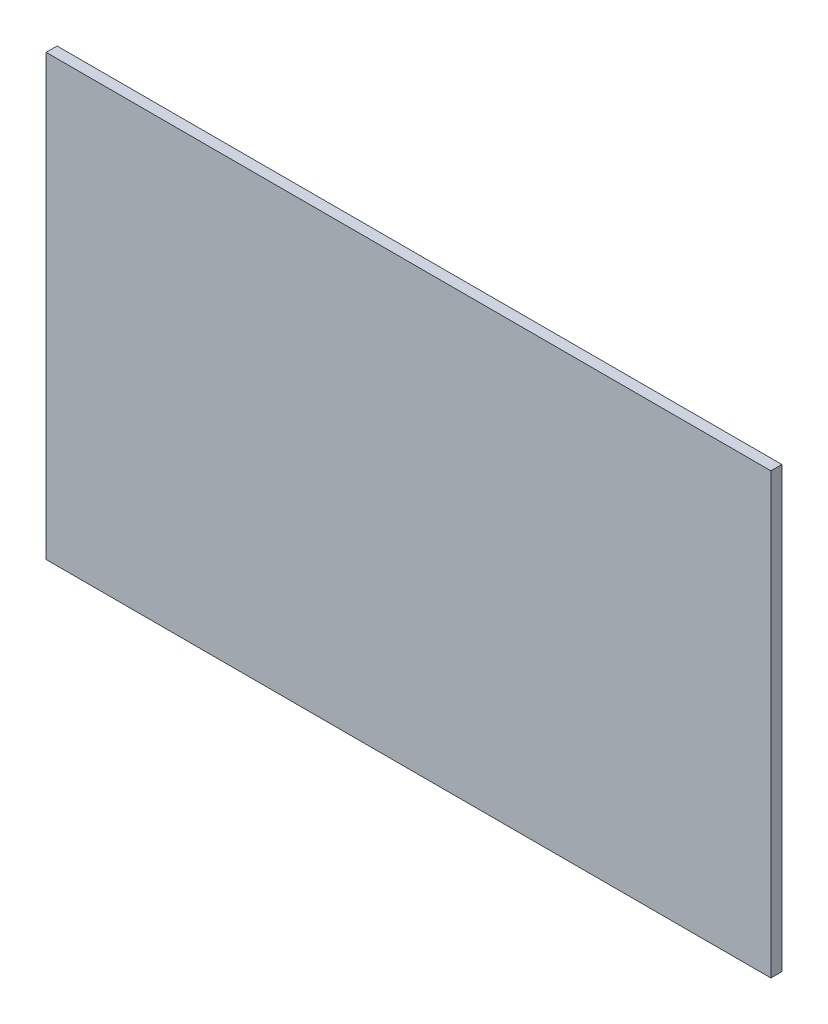
ISO-10303-21;
HEADER;
FILE_DESCRIPTION(('STEP AP214'),'2;1');
FILE_NAME('part.step','',(''),(''),'','','');
FILE_SCHEMA(('AUTOMOTIVE_DESIGN { 1 0 10303 214 1 1 1 1 }'));
ENDSEC;
DATA;
#1=APPLICATION_CONTEXT('core data for automotive mechanical design processes');
#2=APPLICATION_PROTOCOL_DEFINITION('international standard','automotive_design',2000,#1);
#3=PRODUCT_CONTEXT('',#1,'mechanical');
#4=PRODUCT('Part','Part','',(#3));
#5=PRODUCT_RELATED_PRODUCT_CATEGORY('part','',(#4));
#6=PRODUCT_DEFINITION_FORMATION('','',#4);
#7=PRODUCT_DEFINITION_CONTEXT('part definition',#1,'design');
#8=PRODUCT_DEFINITION('design','',#6,#7);
#9=PRODUCT_DEFINITION_SHAPE('','',#8);
#10=(LENGTH_UNIT() NAMED_UNIT(*) SI_UNIT(.MILLI.,.METRE.));
#11=(NAMED_UNIT(*) PLANE_ANGLE_UNIT() SI_UNIT($,.RADIAN.));
#12=(NAMED_UNIT(*) SI_UNIT($,.STERADIAN.) SOLID_ANGLE_UNIT());
#13=UNCERTAINTY_MEASURE_WITH_UNIT(LENGTH_MEASURE(1.E-05),#10,'distance_accuracy_value','');
#14=(GEOMETRIC_REPRESENTATION_CONTEXT(3) GLOBAL_UNCERTAINTY_ASSIGNED_CONTEXT((#13)) GLOBAL_UNIT_ASSIGNED_CONTEXT((#10,
#11,#12)) REPRESENTATION_CONTEXT('',''));
#15=CARTESIAN_POINT('',(0.,0.,0.));
#16=DIRECTION('',(0.,0.,1.));
#17=DIRECTION('',(1.,0.,0.));
#18=AXIS2_PLACEMENT_3D('',#15,#16,#17);
#19=CARTESIAN_POINT('',(0.,0.,76.2));
#20=DIRECTION('',(1.,0.,0.));
#21=DIRECTION('',(0.,0.,-1.));
#22=AXIS2_PLACEMENT_3D('',#19,#20,#21);
#23=PLANE('',#22);
#24=DIRECTION('',(0.,-1.,0.));
#25=VECTOR('',#24,1.);
#26=CARTESIAN_POINT('',(0.,0.,0.));
#27=LINE('',#26,#25);
#28=CARTESIAN_POINT('',(0.,3048.,0.));
#29=VERTEX_POINT('',#28);
#30=CARTESIAN_POINT('',(0.,0.,0.));
#31=VERTEX_POINT('',#30);
#32=EDGE_CURVE('E95',#29,#31,#27,.T.);
#33=ORIENTED_EDGE('',*,*,#32,.T.);
#34=DIRECTION('',(0.,0.,-1.));
#35=VECTOR('',#34,1.);
#36=CARTESIAN_POINT('',(0.,0.,76.2));
#37=LINE('',#36,#35);
#38=CARTESIAN_POINT('',(0.,0.,76.2));
#39=VERTEX_POINT('',#38);
#40=EDGE_CURVE('E11',#39,#31,#37,.T.);
#41=ORIENTED_EDGE('',*,*,#40,.F.);
#42=DIRECTION('',(0.,-1.,0.));
#43=VECTOR('',#42,1.);
#44=CARTESIAN_POINT('',(0.,0.,76.2));
#45=LINE('',#44,#43);
#46=CARTESIAN_POINT('',(0.,3048.,76.2));
#47=VERTEX_POINT('',#46);
#48=EDGE_CURVE('E83',#47,#39,#45,.T.);
#49=ORIENTED_EDGE('',*,*,#48,.F.);
#50=DIRECTION('',(0.,0.,-1.));
#51=VECTOR('',#50,1.);
#52=CARTESIAN_POINT('',(0.,3048.,76.2));
#53=LINE('',#52,#51);
#54=EDGE_CURVE('E91',#47,#29,#53,.T.);
#55=ORIENTED_EDGE('',*,*,#54,.T.);
#56=EDGE_LOOP('',(#33,#41,#49,#55));
#57=FACE_BOUND('',#56,.T.);
#58=ADVANCED_FACE('F32',(#57),#23,.F.);
#59=CARTESIAN_POINT('',(0.,0.,76.2));
#60=DIRECTION('',(0.,1.,0.));
#61=DIRECTION('',(0.,0.,1.));
#62=AXIS2_PLACEMENT_3D('',#59,#60,#61);
#63=PLANE('',#62);
#64=DIRECTION('',(1.,0.,0.));
#65=VECTOR('',#64,1.);
#66=CARTESIAN_POINT('',(0.,0.,0.));
#67=LINE('',#66,#65);
#68=CARTESIAN_POINT('',(5029.2,0.,0.));
#69=VERTEX_POINT('',#68);
#70=EDGE_CURVE('E87',#31,#69,#67,.T.);
#71=ORIENTED_EDGE('',*,*,#70,.T.);
#72=DIRECTION('',(0.,0.,-1.));
#73=VECTOR('',#72,1.);
#74=CARTESIAN_POINT('',(5029.2,0.,76.2));
#75=LINE('',#74,#73);
#76=CARTESIAN_POINT('',(5029.2,0.,76.2));
#77=VERTEX_POINT('',#76);
#78=EDGE_CURVE('E40',#77,#69,#75,.T.);
#79=ORIENTED_EDGE('',*,*,#78,.F.);
#80=DIRECTION('',(1.,0.,0.));
#81=VECTOR('',#80,1.);
#82=CARTESIAN_POINT('',(0.,0.,76.2));
#83=LINE('',#82,#81);
#84=EDGE_CURVE('E78',#39,#77,#83,.T.);
#85=ORIENTED_EDGE('',*,*,#84,.F.);
#86=ORIENTED_EDGE('',*,*,#40,.T.);
#87=EDGE_LOOP('',(#71,#79,#85,#86));
#88=FACE_BOUND('',#87,.T.);
#89=ADVANCED_FACE('F86',(#88),#63,.F.);
#90=CARTESIAN_POINT('',(5029.2,0.,76.2));
#91=DIRECTION('',(-1.,0.,0.));
#92=DIRECTION('',(0.,0.,1.));
#93=AXIS2_PLACEMENT_3D('',#90,#91,#92);
#94=PLANE('',#93);
#95=DIRECTION('',(0.,1.,0.));
#96=VECTOR('',#95,1.);
#97=CARTESIAN_POINT('',(5029.2,0.,0.));
#98=LINE('',#97,#96);
#99=CARTESIAN_POINT('',(5029.2,3048.,0.));
#100=VERTEX_POINT('',#99);
#101=EDGE_CURVE('E65',#69,#100,#98,.T.);
#102=ORIENTED_EDGE('',*,*,#101,.T.);
#103=DIRECTION('',(0.,0.,-1.));
#104=VECTOR('',#103,1.);
#105=CARTESIAN_POINT('',(5029.2,3048.,76.2));
#106=LINE('',#105,#104);
#107=CARTESIAN_POINT('',(5029.2,3048.,76.2));
#108=VERTEX_POINT('',#107);
#109=EDGE_CURVE('E88',#108,#100,#106,.T.);
#110=ORIENTED_EDGE('',*,*,#109,.F.);
#111=DIRECTION('',(0.,1.,0.));
#112=VECTOR('',#111,1.);
#113=CARTESIAN_POINT('',(5029.2,0.,76.2));
#114=LINE('',#113,#112);
#115=EDGE_CURVE('E81',#77,#108,#114,.T.);
#116=ORIENTED_EDGE('',*,*,#115,.F.);
#117=ORIENTED_EDGE('',*,*,#78,.T.);
#118=EDGE_LOOP('',(#102,#110,#116,#117));
#119=FACE_BOUND('',#118,.T.);
#120=ADVANCED_FACE('F89',(#119),#94,.F.);
#121=CARTESIAN_POINT('',(0.,3048.,76.2));
#122=DIRECTION('',(0.,-1.,0.));
#123=DIRECTION('',(0.,0.,-1.));
#124=AXIS2_PLACEMENT_3D('',#121,#122,#123);
#125=PLANE('',#124);
#126=DIRECTION('',(-1.,0.,0.));
#127=VECTOR('',#126,1.);
#128=CARTESIAN_POINT('',(0.,3048.,0.));
#129=LINE('',#128,#127);
#130=EDGE_CURVE('E71',#100,#29,#129,.T.);
#131=ORIENTED_EDGE('',*,*,#130,.T.);
#132=ORIENTED_EDGE('',*,*,#54,.F.);
#133=DIRECTION('',(-1.,0.,0.));
#134=VECTOR('',#133,1.);
#135=CARTESIAN_POINT('',(0.,3048.,76.2));
#136=LINE('',#135,#134);
#137=EDGE_CURVE('E48',#108,#47,#136,.T.);
#138=ORIENTED_EDGE('',*,*,#137,.F.);
#139=ORIENTED_EDGE('',*,*,#109,.T.);
#140=EDGE_LOOP('',(#131,#132,#138,#139));
#141=FACE_BOUND('',#140,.T.);
#142=ADVANCED_FACE('F102',(#141),#125,.F.);
#143=CARTESIAN_POINT('',(0.,0.,76.2));
#144=DIRECTION('',(0.,0.,-1.));
#145=DIRECTION('',(-1.,0.,0.));
#146=AXIS2_PLACEMENT_3D('',#143,#144,#145);
#147=PLANE('',#146);
#148=ORIENTED_EDGE('',*,*,#48,.T.);
#149=ORIENTED_EDGE('',*,*,#84,.T.);
#150=ORIENTED_EDGE('',*,*,#115,.T.);
#151=ORIENTED_EDGE('',*,*,#137,.T.);
#152=EDGE_LOOP('',(#148,#149,#150,#151));
#153=FACE_BOUND('',#152,.T.);
#154=ADVANCED_FACE('F79',(#153),#147,.F.);
#155=CARTESIAN_POINT('',(0.,0.,0.));
#156=DIRECTION('',(0.,0.,-1.));
#157=DIRECTION('',(-1.,0.,0.));
#158=AXIS2_PLACEMENT_3D('',#155,#156,#157);
#159=PLANE('',#158);
#160=ORIENTED_EDGE('',*,*,#32,.F.);
#161=ORIENTED_EDGE('',*,*,#130,.F.);
#162=ORIENTED_EDGE('',*,*,#101,.F.);
#163=ORIENTED_EDGE('',*,*,#70,.F.);
#164=EDGE_LOOP('',(#160,#161,#162,#163));
#165=FACE_BOUND('',#164,.T.);
#166=ADVANCED_FACE('F105',(#165),#159,.T.);
#167=CLOSED_SHELL('',(#58,#89,#120,#142,#154,#166));
#168=MANIFOLD_SOLID_BREP('B2',#167);
#169=ADVANCED_BREP_SHAPE_REPRESENTATION('',(#18,#168),#14);
#170=SHAPE_DEFINITION_REPRESENTATION(#9,#169);
ENDSEC;
END-ISO-10303-21;
